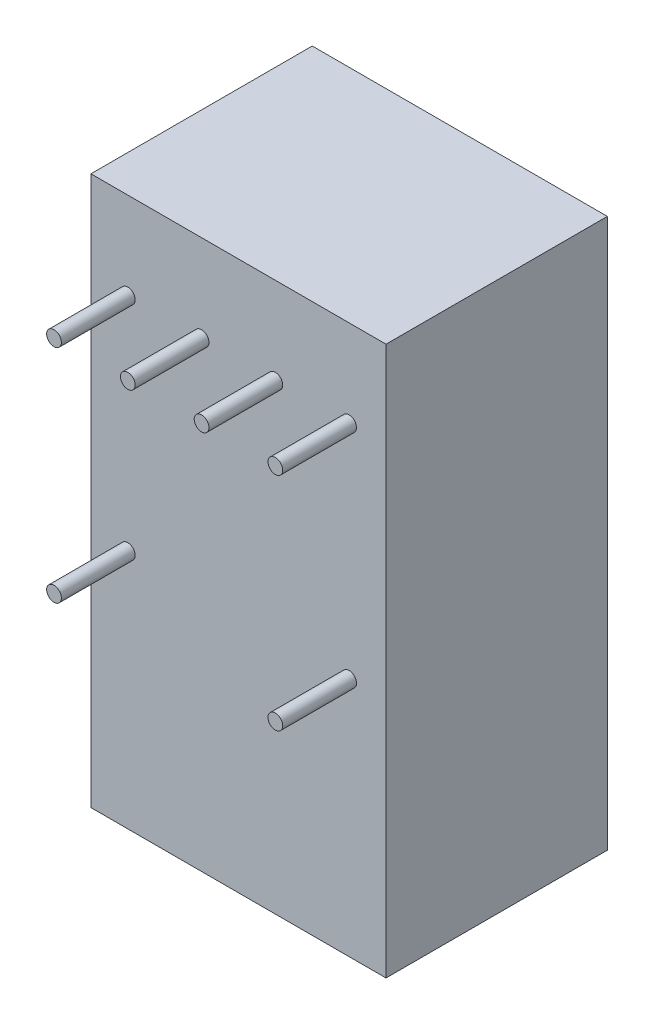
ISO-10303-21;
HEADER;
FILE_DESCRIPTION(('STEP AP214'),'2;1');
FILE_NAME('part.step','',(''),(''),'','','');
FILE_SCHEMA(('AUTOMOTIVE_DESIGN { 1 0 10303 214 1 1 1 1 }'));
ENDSEC;
DATA;
#1=APPLICATION_CONTEXT('core data for automotive mechanical design processes');
#2=APPLICATION_PROTOCOL_DEFINITION('international standard','automotive_design',2000,#1);
#3=PRODUCT_CONTEXT('',#1,'mechanical');
#4=PRODUCT('Part','Part','',(#3));
#5=PRODUCT_RELATED_PRODUCT_CATEGORY('part','',(#4));
#6=PRODUCT_DEFINITION_FORMATION('','',#4);
#7=PRODUCT_DEFINITION_CONTEXT('part definition',#1,'design');
#8=PRODUCT_DEFINITION('design','',#6,#7);
#9=PRODUCT_DEFINITION_SHAPE('','',#8);
#10=(LENGTH_UNIT() NAMED_UNIT(*) SI_UNIT(.MILLI.,.METRE.));
#11=(NAMED_UNIT(*) PLANE_ANGLE_UNIT() SI_UNIT($,.RADIAN.));
#12=(NAMED_UNIT(*) SI_UNIT($,.STERADIAN.) SOLID_ANGLE_UNIT());
#13=UNCERTAINTY_MEASURE_WITH_UNIT(LENGTH_MEASURE(1.E-05),#10,'distance_accuracy_value','');
#14=(GEOMETRIC_REPRESENTATION_CONTEXT(3) GLOBAL_UNCERTAINTY_ASSIGNED_CONTEXT((#13)) GLOBAL_UNIT_ASSIGNED_CONTEXT((#10,
#11,#12)) REPRESENTATION_CONTEXT('',''));
#15=CARTESIAN_POINT('',(0.,0.,0.));
#16=DIRECTION('',(0.,0.,1.));
#17=DIRECTION('',(1.,0.,0.));
#18=AXIS2_PLACEMENT_3D('',#15,#16,#17);
#19=CARTESIAN_POINT('',(8.89,-15.9004,0.));
#20=DIRECTION('',(0.,0.,-1.));
#21=DIRECTION('',(-1.,0.,0.));
#22=AXIS2_PLACEMENT_3D('',#19,#20,#21);
#23=PLANE('',#22);
#24=CARTESIAN_POINT('',(0.,-7.62,0.));
#25=DIRECTION('',(0.,0.,-1.));
#26=DIRECTION('',(-1.,0.,0.));
#27=AXIS2_PLACEMENT_3D('',#24,#25,#26);
#28=CIRCLE('',#27,0.254000000000001);
#29=CARTESIAN_POINT('',(-0.254000000000001,-7.62,0.));
#30=VERTEX_POINT('',#29);
#31=EDGE_CURVE('E37',#30,#30,#28,.F.);
#32=ORIENTED_EDGE('',*,*,#31,.F.);
#33=EDGE_LOOP('',(#32));
#34=FACE_BOUND('',#33,.T.);
#35=CARTESIAN_POINT('',(5.08,0.,0.));
#36=DIRECTION('',(0.,0.,-1.));
#37=DIRECTION('',(-1.,0.,0.));
#38=AXIS2_PLACEMENT_3D('',#35,#36,#37);
#39=CIRCLE('',#38,0.254000000000001);
#40=CARTESIAN_POINT('',(4.826,0.,0.));
#41=VERTEX_POINT('',#40);
#42=EDGE_CURVE('E121',#41,#41,#39,.F.);
#43=ORIENTED_EDGE('',*,*,#42,.F.);
#44=EDGE_LOOP('',(#43));
#45=FACE_BOUND('',#44,.T.);
#46=CARTESIAN_POINT('',(0.,0.,0.));
#47=DIRECTION('',(0.,0.,-1.));
#48=DIRECTION('',(-1.,0.,0.));
#49=AXIS2_PLACEMENT_3D('',#46,#47,#48);
#50=CIRCLE('',#49,0.254);
#51=CARTESIAN_POINT('',(-0.254,0.,0.));
#52=VERTEX_POINT('',#51);
#53=EDGE_CURVE('E87',#52,#52,#50,.T.);
#54=ORIENTED_EDGE('',*,*,#53,.T.);
#55=EDGE_LOOP('',(#54));
#56=FACE_BOUND('',#55,.T.);
#57=DIRECTION('',(0.,-1.,0.));
#58=VECTOR('',#57,1.);
#59=CARTESIAN_POINT('',(8.89,2.9972,0.));
#60=LINE('',#59,#58);
#61=CARTESIAN_POINT('',(8.89,2.9972,0.));
#62=VERTEX_POINT('',#61);
#63=CARTESIAN_POINT('',(8.89,-15.9004,0.));
#64=VERTEX_POINT('',#63);
#65=EDGE_CURVE('E75',#62,#64,#60,.T.);
#66=ORIENTED_EDGE('',*,*,#65,.F.);
#67=DIRECTION('',(1.,0.,0.));
#68=VECTOR('',#67,1.);
#69=CARTESIAN_POINT('',(8.89,2.9972,0.));
#70=LINE('',#69,#68);
#71=CARTESIAN_POINT('',(-1.27,2.9972,0.));
#72=VERTEX_POINT('',#71);
#73=EDGE_CURVE('E101',#72,#62,#70,.T.);
#74=ORIENTED_EDGE('',*,*,#73,.F.);
#75=DIRECTION('',(0.,1.,0.));
#76=VECTOR('',#75,1.);
#77=CARTESIAN_POINT('',(-1.27,2.9972,0.));
#78=LINE('',#77,#76);
#79=CARTESIAN_POINT('',(-1.27,-15.9004,0.));
#80=VERTEX_POINT('',#79);
#81=EDGE_CURVE('E76',#80,#72,#78,.T.);
#82=ORIENTED_EDGE('',*,*,#81,.F.);
#83=DIRECTION('',(-1.,0.,0.));
#84=VECTOR('',#83,1.);
#85=CARTESIAN_POINT('',(8.89,-15.9004,0.));
#86=LINE('',#85,#84);
#87=EDGE_CURVE('E70',#64,#80,#86,.T.);
#88=ORIENTED_EDGE('',*,*,#87,.F.);
#89=EDGE_LOOP('',(#66,#74,#82,#88));
#90=FACE_BOUND('',#89,.T.);
#91=CARTESIAN_POINT('',(2.54,0.,0.));
#92=DIRECTION('',(0.,0.,-1.));
#93=DIRECTION('',(-1.,0.,0.));
#94=AXIS2_PLACEMENT_3D('',#91,#92,#93);
#95=CIRCLE('',#94,0.254000000000001);
#96=CARTESIAN_POINT('',(2.286,0.,0.));
#97=VERTEX_POINT('',#96);
#98=EDGE_CURVE('E118',#97,#97,#95,.F.);
#99=ORIENTED_EDGE('',*,*,#98,.F.);
#100=EDGE_LOOP('',(#99));
#101=FACE_BOUND('',#100,.T.);
#102=CARTESIAN_POINT('',(7.62,0.,0.));
#103=DIRECTION('',(0.,0.,-1.));
#104=DIRECTION('',(-1.,0.,0.));
#105=AXIS2_PLACEMENT_3D('',#102,#103,#104);
#106=CIRCLE('',#105,0.253999999999994);
#107=CARTESIAN_POINT('',(7.36600000000001,0.,0.));
#108=VERTEX_POINT('',#107);
#109=EDGE_CURVE('E124',#108,#108,#106,.F.);
#110=ORIENTED_EDGE('',*,*,#109,.F.);
#111=EDGE_LOOP('',(#110));
#112=FACE_BOUND('',#111,.T.);
#113=CARTESIAN_POINT('',(7.62,-7.62,0.));
#114=DIRECTION('',(0.,0.,-1.));
#115=DIRECTION('',(-1.,0.,0.));
#116=AXIS2_PLACEMENT_3D('',#113,#114,#115);
#117=CIRCLE('',#116,0.253999999999994);
#118=CARTESIAN_POINT('',(7.366,-7.62,0.));
#119=VERTEX_POINT('',#118);
#120=EDGE_CURVE('E11',#119,#119,#117,.F.);
#121=ORIENTED_EDGE('',*,*,#120,.F.);
#122=EDGE_LOOP('',(#121));
#123=FACE_BOUND('',#122,.T.);
#124=ADVANCED_FACE('F29',(#34,#45,#56,#90,#101,#112,#123),#23,.F.);
#125=CARTESIAN_POINT('',(0.,0.,2.54));
#126=DIRECTION('',(0.,0.,-1.));
#127=DIRECTION('',(-1.,0.,0.));
#128=AXIS2_PLACEMENT_3D('',#125,#126,#127);
#129=CYLINDRICAL_SURFACE('',#128,0.254);
#130=CARTESIAN_POINT('',(0.,0.,2.54));
#131=DIRECTION('',(0.,0.,1.));
#132=DIRECTION('',(1.,0.,0.));
#133=AXIS2_PLACEMENT_3D('',#130,#131,#132);
#134=CIRCLE('',#133,0.254);
#135=CARTESIAN_POINT('',(0.254,0.,2.54));
#136=VERTEX_POINT('',#135);
#137=EDGE_CURVE('E115',#136,#136,#134,.T.);
#138=ORIENTED_EDGE('',*,*,#137,.F.);
#139=EDGE_LOOP('',(#138));
#140=FACE_BOUND('',#139,.T.);
#141=ORIENTED_EDGE('',*,*,#53,.F.);
#142=EDGE_LOOP('',(#141));
#143=FACE_BOUND('',#142,.T.);
#144=ADVANCED_FACE('F31',(#140,#143),#129,.T.);
#145=CARTESIAN_POINT('',(0.,0.,2.54));
#146=DIRECTION('',(0.,0.,1.));
#147=DIRECTION('',(1.,0.,0.));
#148=AXIS2_PLACEMENT_3D('',#145,#146,#147);
#149=PLANE('',#148);
#150=ORIENTED_EDGE('',*,*,#137,.T.);
#151=EDGE_LOOP('',(#150));
#152=FACE_BOUND('',#151,.T.);
#153=ADVANCED_FACE('F139',(#152),#149,.T.);
#154=CARTESIAN_POINT('',(8.89,2.9972,-7.62));
#155=DIRECTION('',(-1.,0.,0.));
#156=DIRECTION('',(0.,-1.,0.));
#157=AXIS2_PLACEMENT_3D('',#154,#155,#156);
#158=PLANE('',#157);
#159=ORIENTED_EDGE('',*,*,#65,.T.);
#160=DIRECTION('',(0.,0.,1.));
#161=VECTOR('',#160,1.);
#162=CARTESIAN_POINT('',(8.89,-15.9004,-7.62));
#163=LINE('',#162,#161);
#164=CARTESIAN_POINT('',(8.89,-15.9004,-7.62));
#165=VERTEX_POINT('',#164);
#166=EDGE_CURVE('E82',#165,#64,#163,.T.);
#167=ORIENTED_EDGE('',*,*,#166,.F.);
#168=DIRECTION('',(0.,-1.,0.));
#169=VECTOR('',#168,1.);
#170=CARTESIAN_POINT('',(8.89,2.9972,-7.62));
#171=LINE('',#170,#169);
#172=CARTESIAN_POINT('',(8.89,2.9972,-7.62));
#173=VERTEX_POINT('',#172);
#174=EDGE_CURVE('E103',#173,#165,#171,.T.);
#175=ORIENTED_EDGE('',*,*,#174,.F.);
#176=DIRECTION('',(0.,0.,1.));
#177=VECTOR('',#176,1.);
#178=CARTESIAN_POINT('',(8.89,2.9972,-7.62));
#179=LINE('',#178,#177);
#180=EDGE_CURVE('E92',#173,#62,#179,.T.);
#181=ORIENTED_EDGE('',*,*,#180,.T.);
#182=EDGE_LOOP('',(#159,#167,#175,#181));
#183=FACE_BOUND('',#182,.T.);
#184=ADVANCED_FACE('F91',(#183),#158,.F.);
#185=CARTESIAN_POINT('',(8.89,-15.9004,-7.62));
#186=DIRECTION('',(0.,1.,0.));
#187=DIRECTION('',(0.,0.,1.));
#188=AXIS2_PLACEMENT_3D('',#185,#186,#187);
#189=PLANE('',#188);
#190=ORIENTED_EDGE('',*,*,#87,.T.);
#191=DIRECTION('',(0.,0.,1.));
#192=VECTOR('',#191,1.);
#193=CARTESIAN_POINT('',(-1.27,-15.9004,-7.62));
#194=LINE('',#193,#192);
#195=CARTESIAN_POINT('',(-1.27,-15.9004,-7.62));
#196=VERTEX_POINT('',#195);
#197=EDGE_CURVE('E88',#196,#80,#194,.T.);
#198=ORIENTED_EDGE('',*,*,#197,.F.);
#199=DIRECTION('',(-1.,0.,0.));
#200=VECTOR('',#199,1.);
#201=CARTESIAN_POINT('',(8.89,-15.9004,-7.62));
#202=LINE('',#201,#200);
#203=EDGE_CURVE('E84',#165,#196,#202,.T.);
#204=ORIENTED_EDGE('',*,*,#203,.F.);
#205=ORIENTED_EDGE('',*,*,#166,.T.);
#206=EDGE_LOOP('',(#190,#198,#204,#205));
#207=FACE_BOUND('',#206,.T.);
#208=ADVANCED_FACE('F83',(#207),#189,.F.);
#209=CARTESIAN_POINT('',(-1.27,2.9972,-7.62));
#210=DIRECTION('',(1.,0.,0.));
#211=DIRECTION('',(0.,1.,0.));
#212=AXIS2_PLACEMENT_3D('',#209,#210,#211);
#213=PLANE('',#212);
#214=ORIENTED_EDGE('',*,*,#81,.T.);
#215=DIRECTION('',(0.,0.,1.));
#216=VECTOR('',#215,1.);
#217=CARTESIAN_POINT('',(-1.27,2.9972,-7.62));
#218=LINE('',#217,#216);
#219=CARTESIAN_POINT('',(-1.27,2.9972,-7.62));
#220=VERTEX_POINT('',#219);
#221=EDGE_CURVE('E109',#220,#72,#218,.T.);
#222=ORIENTED_EDGE('',*,*,#221,.F.);
#223=DIRECTION('',(0.,1.,0.));
#224=VECTOR('',#223,1.);
#225=CARTESIAN_POINT('',(-1.27,2.9972,-7.62));
#226=LINE('',#225,#224);
#227=EDGE_CURVE('E49',#196,#220,#226,.T.);
#228=ORIENTED_EDGE('',*,*,#227,.F.);
#229=ORIENTED_EDGE('',*,*,#197,.T.);
#230=EDGE_LOOP('',(#214,#222,#228,#229));
#231=FACE_BOUND('',#230,.T.);
#232=ADVANCED_FACE('F153',(#231),#213,.F.);
#233=CARTESIAN_POINT('',(8.89,2.9972,-7.62));
#234=DIRECTION('',(0.,-1.,0.));
#235=DIRECTION('',(0.,0.,-1.));
#236=AXIS2_PLACEMENT_3D('',#233,#234,#235);
#237=PLANE('',#236);
#238=ORIENTED_EDGE('',*,*,#73,.T.);
#239=ORIENTED_EDGE('',*,*,#180,.F.);
#240=DIRECTION('',(1.,0.,0.));
#241=VECTOR('',#240,1.);
#242=CARTESIAN_POINT('',(8.89,2.9972,-7.62));
#243=LINE('',#242,#241);
#244=EDGE_CURVE('E44',#220,#173,#243,.T.);
#245=ORIENTED_EDGE('',*,*,#244,.F.);
#246=ORIENTED_EDGE('',*,*,#221,.T.);
#247=EDGE_LOOP('',(#238,#239,#245,#246));
#248=FACE_BOUND('',#247,.T.);
#249=ADVANCED_FACE('F156',(#248),#237,.F.);
#250=CARTESIAN_POINT('',(8.89,-15.9004,-7.62));
#251=DIRECTION('',(0.,0.,-1.));
#252=DIRECTION('',(-1.,0.,0.));
#253=AXIS2_PLACEMENT_3D('',#250,#251,#252);
#254=PLANE('',#253);
#255=ORIENTED_EDGE('',*,*,#174,.T.);
#256=ORIENTED_EDGE('',*,*,#203,.T.);
#257=ORIENTED_EDGE('',*,*,#227,.T.);
#258=ORIENTED_EDGE('',*,*,#244,.T.);
#259=EDGE_LOOP('',(#255,#256,#257,#258));
#260=FACE_BOUND('',#259,.T.);
#261=ADVANCED_FACE('F160',(#260),#254,.T.);
#262=CARTESIAN_POINT('',(2.54,0.,2.54));
#263=DIRECTION('',(0.,0.,-1.));
#264=DIRECTION('',(-1.,0.,0.));
#265=AXIS2_PLACEMENT_3D('',#262,#263,#264);
#266=CYLINDRICAL_SURFACE('',#265,0.254000000000001);
#267=CARTESIAN_POINT('',(2.54,0.,2.54));
#268=DIRECTION('',(0.,0.,1.));
#269=DIRECTION('',(1.,0.,0.));
#270=AXIS2_PLACEMENT_3D('',#267,#268,#269);
#271=CIRCLE('',#270,0.254000000000001);
#272=CARTESIAN_POINT('',(2.794,0.,2.54));
#273=VERTEX_POINT('',#272);
#274=EDGE_CURVE('E93',#273,#273,#271,.T.);
#275=ORIENTED_EDGE('',*,*,#274,.F.);
#276=EDGE_LOOP('',(#275));
#277=FACE_BOUND('',#276,.T.);
#278=ORIENTED_EDGE('',*,*,#98,.T.);
#279=EDGE_LOOP('',(#278));
#280=FACE_BOUND('',#279,.T.);
#281=ADVANCED_FACE('F163',(#277,#280),#266,.T.);
#282=CARTESIAN_POINT('',(2.54,0.,2.54));
#283=DIRECTION('',(0.,0.,1.));
#284=DIRECTION('',(1.,0.,0.));
#285=AXIS2_PLACEMENT_3D('',#282,#283,#284);
#286=PLANE('',#285);
#287=ORIENTED_EDGE('',*,*,#274,.T.);
#288=EDGE_LOOP('',(#287));
#289=FACE_BOUND('',#288,.T.);
#290=ADVANCED_FACE('F167',(#289),#286,.T.);
#291=CARTESIAN_POINT('',(5.08,0.,2.54));
#292=DIRECTION('',(0.,0.,-1.));
#293=DIRECTION('',(-1.,0.,0.));
#294=AXIS2_PLACEMENT_3D('',#291,#292,#293);
#295=CYLINDRICAL_SURFACE('',#294,0.254000000000001);
#296=CARTESIAN_POINT('',(5.08,0.,2.54));
#297=DIRECTION('',(0.,0.,1.));
#298=DIRECTION('',(1.,0.,0.));
#299=AXIS2_PLACEMENT_3D('',#296,#297,#298);
#300=CIRCLE('',#299,0.254000000000001);
#301=CARTESIAN_POINT('',(5.334,0.,2.54));
#302=VERTEX_POINT('',#301);
#303=EDGE_CURVE('E96',#302,#302,#300,.T.);
#304=ORIENTED_EDGE('',*,*,#303,.F.);
#305=EDGE_LOOP('',(#304));
#306=FACE_BOUND('',#305,.T.);
#307=ORIENTED_EDGE('',*,*,#42,.T.);
#308=EDGE_LOOP('',(#307));
#309=FACE_BOUND('',#308,.T.);
#310=ADVANCED_FACE('F171',(#306,#309),#295,.T.);
#311=CARTESIAN_POINT('',(5.08,0.,2.54));
#312=DIRECTION('',(0.,0.,1.));
#313=DIRECTION('',(1.,0.,0.));
#314=AXIS2_PLACEMENT_3D('',#311,#312,#313);
#315=PLANE('',#314);
#316=ORIENTED_EDGE('',*,*,#303,.T.);
#317=EDGE_LOOP('',(#316));
#318=FACE_BOUND('',#317,.T.);
#319=ADVANCED_FACE('F175',(#318),#315,.T.);
#320=CARTESIAN_POINT('',(7.62,0.,2.54));
#321=DIRECTION('',(0.,0.,-1.));
#322=DIRECTION('',(-1.,0.,0.));
#323=AXIS2_PLACEMENT_3D('',#320,#321,#322);
#324=CYLINDRICAL_SURFACE('',#323,0.253999999999994);
#325=CARTESIAN_POINT('',(7.62,0.,2.54));
#326=DIRECTION('',(0.,0.,1.));
#327=DIRECTION('',(1.,0.,0.));
#328=AXIS2_PLACEMENT_3D('',#325,#326,#327);
#329=CIRCLE('',#328,0.253999999999994);
#330=CARTESIAN_POINT('',(7.874,0.,2.54));
#331=VERTEX_POINT('',#330);
#332=EDGE_CURVE('E210',#331,#331,#329,.T.);
#333=ORIENTED_EDGE('',*,*,#332,.F.);
#334=EDGE_LOOP('',(#333));
#335=FACE_BOUND('',#334,.T.);
#336=ORIENTED_EDGE('',*,*,#109,.T.);
#337=EDGE_LOOP('',(#336));
#338=FACE_BOUND('',#337,.T.);
#339=ADVANCED_FACE('F179',(#335,#338),#324,.T.);
#340=CARTESIAN_POINT('',(7.62,0.,2.54));
#341=DIRECTION('',(0.,0.,1.));
#342=DIRECTION('',(1.,0.,0.));
#343=AXIS2_PLACEMENT_3D('',#340,#341,#342);
#344=PLANE('',#343);
#345=ORIENTED_EDGE('',*,*,#332,.T.);
#346=EDGE_LOOP('',(#345));
#347=FACE_BOUND('',#346,.T.);
#348=ADVANCED_FACE('F183',(#347),#344,.T.);
#349=CARTESIAN_POINT('',(0.,-7.62,2.54));
#350=DIRECTION('',(0.,0.,-1.));
#351=DIRECTION('',(-1.,0.,0.));
#352=AXIS2_PLACEMENT_3D('',#349,#350,#351);
#353=CYLINDRICAL_SURFACE('',#352,0.254000000000001);
#354=CARTESIAN_POINT('',(0.,-7.62,2.54));
#355=DIRECTION('',(0.,0.,1.));
#356=DIRECTION('',(1.,0.,0.));
#357=AXIS2_PLACEMENT_3D('',#354,#355,#356);
#358=CIRCLE('',#357,0.254000000000001);
#359=CARTESIAN_POINT('',(0.254000000000001,-7.62,2.54));
#360=VERTEX_POINT('',#359);
#361=EDGE_CURVE('E207',#360,#360,#358,.T.);
#362=ORIENTED_EDGE('',*,*,#361,.F.);
#363=EDGE_LOOP('',(#362));
#364=FACE_BOUND('',#363,.T.);
#365=ORIENTED_EDGE('',*,*,#31,.T.);
#366=EDGE_LOOP('',(#365));
#367=FACE_BOUND('',#366,.T.);
#368=ADVANCED_FACE('F129',(#364,#367),#353,.T.);
#369=CARTESIAN_POINT('',(0.,-7.62,2.54));
#370=DIRECTION('',(0.,0.,1.));
#371=DIRECTION('',(1.,0.,0.));
#372=AXIS2_PLACEMENT_3D('',#369,#370,#371);
#373=PLANE('',#372);
#374=ORIENTED_EDGE('',*,*,#361,.T.);
#375=EDGE_LOOP('',(#374));
#376=FACE_BOUND('',#375,.T.);
#377=ADVANCED_FACE('F190',(#376),#373,.T.);
#378=CARTESIAN_POINT('',(7.62,-7.62,2.54));
#379=DIRECTION('',(0.,0.,-1.));
#380=DIRECTION('',(-1.,0.,0.));
#381=AXIS2_PLACEMENT_3D('',#378,#379,#380);
#382=CYLINDRICAL_SURFACE('',#381,0.253999999999994);
#383=CARTESIAN_POINT('',(7.62,-7.62,2.54));
#384=DIRECTION('',(0.,0.,1.));
#385=DIRECTION('',(1.,0.,0.));
#386=AXIS2_PLACEMENT_3D('',#383,#384,#385);
#387=CIRCLE('',#386,0.253999999999994);
#388=CARTESIAN_POINT('',(7.87399999999999,-7.62,2.54));
#389=VERTEX_POINT('',#388);
#390=EDGE_CURVE('E206',#389,#389,#387,.T.);
#391=ORIENTED_EDGE('',*,*,#390,.F.);
#392=EDGE_LOOP('',(#391));
#393=FACE_BOUND('',#392,.T.);
#394=ORIENTED_EDGE('',*,*,#120,.T.);
#395=EDGE_LOOP('',(#394));
#396=FACE_BOUND('',#395,.T.);
#397=ADVANCED_FACE('F194',(#393,#396),#382,.T.);
#398=CARTESIAN_POINT('',(7.62,-7.62,2.54));
#399=DIRECTION('',(0.,0.,1.));
#400=DIRECTION('',(1.,0.,0.));
#401=AXIS2_PLACEMENT_3D('',#398,#399,#400);
#402=PLANE('',#401);
#403=ORIENTED_EDGE('',*,*,#390,.T.);
#404=EDGE_LOOP('',(#403));
#405=FACE_BOUND('',#404,.T.);
#406=ADVANCED_FACE('F198',(#405),#402,.T.);
#407=CLOSED_SHELL('',(#124,#144,#153,#184,#208,#232,#249,#261,#281,#290,#310,#319,#339,#348,
#368,#377,#397,#406));
#408=MANIFOLD_SOLID_BREP('B2',#407);
#409=ADVANCED_BREP_SHAPE_REPRESENTATION('',(#18,#408),#14);
#410=SHAPE_DEFINITION_REPRESENTATION(#9,#409);
ENDSEC;
END-ISO-10303-21;
